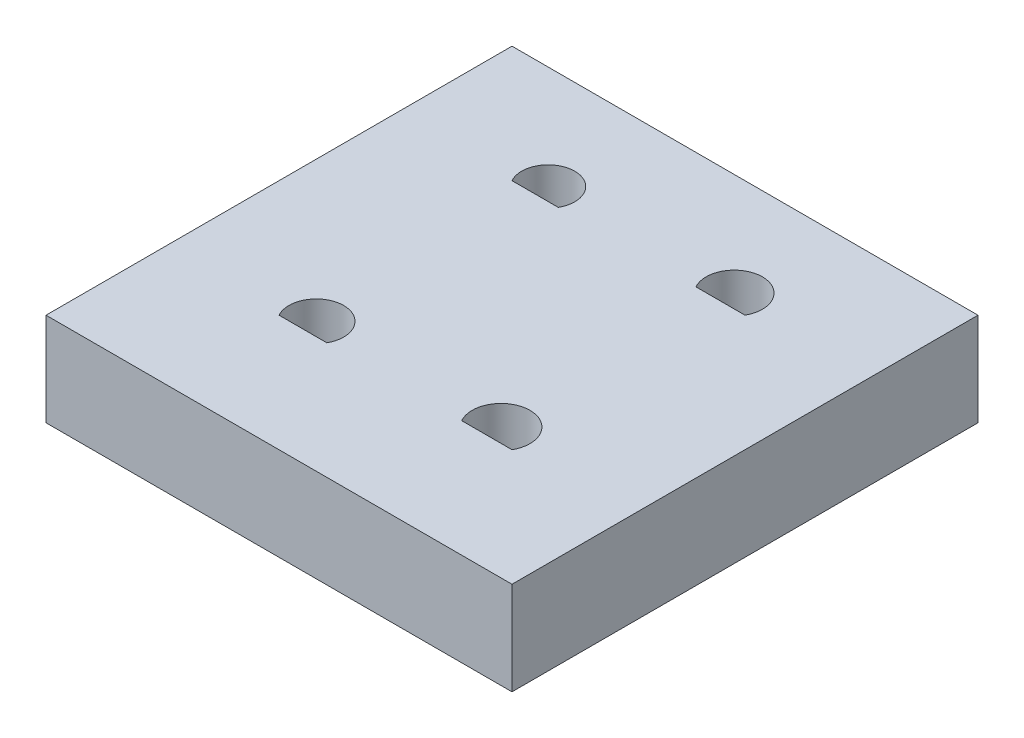
ISO-10303-21;
HEADER;
FILE_DESCRIPTION(('STEP AP214'),'2;1');
FILE_NAME('part.step','',(''),(''),'','','');
FILE_SCHEMA(('AUTOMOTIVE_DESIGN { 1 0 10303 214 1 1 1 1 }'));
ENDSEC;
DATA;
#1=APPLICATION_CONTEXT('core data for automotive mechanical design processes');
#2=APPLICATION_PROTOCOL_DEFINITION('international standard','automotive_design',2000,#1);
#3=PRODUCT_CONTEXT('',#1,'mechanical');
#4=PRODUCT('Part','Part','',(#3));
#5=PRODUCT_RELATED_PRODUCT_CATEGORY('part','',(#4));
#6=PRODUCT_DEFINITION_FORMATION('','',#4);
#7=PRODUCT_DEFINITION_CONTEXT('part definition',#1,'design');
#8=PRODUCT_DEFINITION('design','',#6,#7);
#9=PRODUCT_DEFINITION_SHAPE('','',#8);
#10=(LENGTH_UNIT() NAMED_UNIT(*) SI_UNIT(.MILLI.,.METRE.));
#11=(NAMED_UNIT(*) PLANE_ANGLE_UNIT() SI_UNIT($,.RADIAN.));
#12=(NAMED_UNIT(*) SI_UNIT($,.STERADIAN.) SOLID_ANGLE_UNIT());
#13=UNCERTAINTY_MEASURE_WITH_UNIT(LENGTH_MEASURE(1.E-05),#10,'distance_accuracy_value','');
#14=(GEOMETRIC_REPRESENTATION_CONTEXT(3) GLOBAL_UNCERTAINTY_ASSIGNED_CONTEXT((#13)) GLOBAL_UNIT_ASSIGNED_CONTEXT((#10,
#11,#12)) REPRESENTATION_CONTEXT('',''));
#15=CARTESIAN_POINT('',(0.,0.,0.));
#16=DIRECTION('',(0.,0.,1.));
#17=DIRECTION('',(1.,0.,0.));
#18=AXIS2_PLACEMENT_3D('',#15,#16,#17);
#19=CARTESIAN_POINT('',(0.,5.08,0.));
#20=DIRECTION('',(1.,0.,0.));
#21=DIRECTION('',(0.,0.,-1.));
#22=AXIS2_PLACEMENT_3D('',#19,#20,#21);
#23=PLANE('',#22);
#24=DIRECTION('',(0.,0.,1.));
#25=VECTOR('',#24,1.);
#26=CARTESIAN_POINT('',(0.,0.,0.));
#27=LINE('',#26,#25);
#28=CARTESIAN_POINT('',(0.,0.,-25.4));
#29=VERTEX_POINT('',#28);
#30=CARTESIAN_POINT('',(0.,0.,0.));
#31=VERTEX_POINT('',#30);
#32=EDGE_CURVE('E188',#29,#31,#27,.T.);
#33=ORIENTED_EDGE('',*,*,#32,.T.);
#34=DIRECTION('',(0.,-1.,0.));
#35=VECTOR('',#34,1.);
#36=CARTESIAN_POINT('',(0.,5.08,0.));
#37=LINE('',#36,#35);
#38=CARTESIAN_POINT('',(0.,5.08,0.));
#39=VERTEX_POINT('',#38);
#40=EDGE_CURVE('E11',#39,#31,#37,.T.);
#41=ORIENTED_EDGE('',*,*,#40,.F.);
#42=DIRECTION('',(0.,0.,1.));
#43=VECTOR('',#42,1.);
#44=CARTESIAN_POINT('',(0.,5.08,0.));
#45=LINE('',#44,#43);
#46=CARTESIAN_POINT('',(0.,5.08,-25.4));
#47=VERTEX_POINT('',#46);
#48=EDGE_CURVE('E191',#47,#39,#45,.T.);
#49=ORIENTED_EDGE('',*,*,#48,.F.);
#50=DIRECTION('',(0.,-1.,0.));
#51=VECTOR('',#50,1.);
#52=CARTESIAN_POINT('',(0.,5.08,-25.4));
#53=LINE('',#52,#51);
#54=EDGE_CURVE('E201',#47,#29,#53,.T.);
#55=ORIENTED_EDGE('',*,*,#54,.T.);
#56=EDGE_LOOP('',(#33,#41,#49,#55));
#57=FACE_BOUND('',#56,.T.);
#58=ADVANCED_FACE('F33',(#57),#23,.F.);
#59=CARTESIAN_POINT('',(0.,5.08,0.));
#60=DIRECTION('',(0.,0.,-1.));
#61=DIRECTION('',(-1.,0.,0.));
#62=AXIS2_PLACEMENT_3D('',#59,#60,#61);
#63=PLANE('',#62);
#64=DIRECTION('',(1.,0.,0.));
#65=VECTOR('',#64,1.);
#66=CARTESIAN_POINT('',(0.,0.,0.));
#67=LINE('',#66,#65);
#68=CARTESIAN_POINT('',(25.4,0.,0.));
#69=VERTEX_POINT('',#68);
#70=EDGE_CURVE('E204',#31,#69,#67,.T.);
#71=ORIENTED_EDGE('',*,*,#70,.T.);
#72=DIRECTION('',(0.,-1.,0.));
#73=VECTOR('',#72,1.);
#74=CARTESIAN_POINT('',(25.4,5.08,0.));
#75=LINE('',#74,#73);
#76=CARTESIAN_POINT('',(25.4,5.08,0.));
#77=VERTEX_POINT('',#76);
#78=EDGE_CURVE('E40',#77,#69,#75,.T.);
#79=ORIENTED_EDGE('',*,*,#78,.F.);
#80=DIRECTION('',(1.,0.,0.));
#81=VECTOR('',#80,1.);
#82=CARTESIAN_POINT('',(0.,5.08,0.));
#83=LINE('',#82,#81);
#84=EDGE_CURVE('E194',#39,#77,#83,.T.);
#85=ORIENTED_EDGE('',*,*,#84,.F.);
#86=ORIENTED_EDGE('',*,*,#40,.T.);
#87=EDGE_LOOP('',(#71,#79,#85,#86));
#88=FACE_BOUND('',#87,.T.);
#89=ADVANCED_FACE('F233',(#88),#63,.F.);
#90=CARTESIAN_POINT('',(25.4,5.08,0.));
#91=DIRECTION('',(-1.,0.,0.));
#92=DIRECTION('',(0.,0.,1.));
#93=AXIS2_PLACEMENT_3D('',#90,#91,#92);
#94=PLANE('',#93);
#95=DIRECTION('',(0.,0.,-1.));
#96=VECTOR('',#95,1.);
#97=CARTESIAN_POINT('',(25.4,0.,0.));
#98=LINE('',#97,#96);
#99=CARTESIAN_POINT('',(25.4,0.,-25.4));
#100=VERTEX_POINT('',#99);
#101=EDGE_CURVE('E206',#69,#100,#98,.T.);
#102=ORIENTED_EDGE('',*,*,#101,.T.);
#103=DIRECTION('',(0.,-1.,0.));
#104=VECTOR('',#103,1.);
#105=CARTESIAN_POINT('',(25.4,5.08,-25.4));
#106=LINE('',#105,#104);
#107=CARTESIAN_POINT('',(25.4,5.08,-25.4));
#108=VERTEX_POINT('',#107);
#109=EDGE_CURVE('E211',#108,#100,#106,.T.);
#110=ORIENTED_EDGE('',*,*,#109,.F.);
#111=DIRECTION('',(0.,0.,-1.));
#112=VECTOR('',#111,1.);
#113=CARTESIAN_POINT('',(25.4,5.08,0.));
#114=LINE('',#113,#112);
#115=EDGE_CURVE('E197',#77,#108,#114,.T.);
#116=ORIENTED_EDGE('',*,*,#115,.F.);
#117=ORIENTED_EDGE('',*,*,#78,.T.);
#118=EDGE_LOOP('',(#102,#110,#116,#117));
#119=FACE_BOUND('',#118,.T.);
#120=ADVANCED_FACE('F218',(#119),#94,.F.);
#121=CARTESIAN_POINT('',(0.,5.08,-25.4));
#122=DIRECTION('',(0.,0.,1.));
#123=DIRECTION('',(1.,0.,0.));
#124=AXIS2_PLACEMENT_3D('',#121,#122,#123);
#125=PLANE('',#124);
#126=DIRECTION('',(-1.,0.,0.));
#127=VECTOR('',#126,1.);
#128=CARTESIAN_POINT('',(0.,0.,-25.4));
#129=LINE('',#128,#127);
#130=EDGE_CURVE('E195',#100,#29,#129,.T.);
#131=ORIENTED_EDGE('',*,*,#130,.T.);
#132=ORIENTED_EDGE('',*,*,#54,.F.);
#133=DIRECTION('',(-1.,0.,0.));
#134=VECTOR('',#133,1.);
#135=CARTESIAN_POINT('',(0.,5.08,-25.4));
#136=LINE('',#135,#134);
#137=EDGE_CURVE('E199',#108,#47,#136,.T.);
#138=ORIENTED_EDGE('',*,*,#137,.F.);
#139=ORIENTED_EDGE('',*,*,#109,.T.);
#140=EDGE_LOOP('',(#131,#132,#138,#139));
#141=FACE_BOUND('',#140,.T.);
#142=ADVANCED_FACE('F226',(#141),#125,.F.);
#143=CARTESIAN_POINT('',(0.,5.08,0.));
#144=DIRECTION('',(0.,-1.,0.));
#145=DIRECTION('',(0.,0.,-1.));
#146=AXIS2_PLACEMENT_3D('',#143,#144,#145);
#147=PLANE('',#146);
#148=DIRECTION('',(1.,0.,0.));
#149=VECTOR('',#148,1.);
#150=CARTESIAN_POINT('',(16.3753908547229,5.08,-19.05));
#151=LINE('',#150,#149);
#152=CARTESIAN_POINT('',(16.3753908547229,5.08,-19.05));
#153=VERTEX_POINT('',#152);
#154=CARTESIAN_POINT('',(19.05,5.08,-19.05));
#155=VERTEX_POINT('',#154);
#156=EDGE_CURVE('E166',#153,#155,#151,.T.);
#157=ORIENTED_EDGE('',*,*,#156,.F.);
#158=CARTESIAN_POINT('',(17.7126954273614,5.08,-19.80184));
#159=DIRECTION('',(0.,1.,0.));
#160=DIRECTION('',(0.,0.,1.));
#161=AXIS2_PLACEMENT_3D('',#158,#159,#160);
#162=CIRCLE('',#161,1.53416);
#163=EDGE_CURVE('E47',#155,#153,#162,.T.);
#164=ORIENTED_EDGE('',*,*,#163,.F.);
#165=EDGE_LOOP('',(#157,#164));
#166=FACE_BOUND('',#165,.T.);
#167=DIRECTION('',(1.,0.,0.));
#168=VECTOR('',#167,1.);
#169=CARTESIAN_POINT('',(6.35,5.08,-19.05));
#170=LINE('',#169,#168);
#171=CARTESIAN_POINT('',(6.35,5.08,-19.05));
#172=VERTEX_POINT('',#171);
#173=CARTESIAN_POINT('',(8.87215733054066,5.08,-19.05));
#174=VERTEX_POINT('',#173);
#175=EDGE_CURVE('E152',#172,#174,#170,.T.);
#176=ORIENTED_EDGE('',*,*,#175,.F.);
#177=CARTESIAN_POINT('',(7.61107866527033,5.08,-19.7612));
#178=DIRECTION('',(0.,1.,0.));
#179=DIRECTION('',(0.,0.,1.));
#180=AXIS2_PLACEMENT_3D('',#177,#178,#179);
#181=CIRCLE('',#180,1.4478);
#182=EDGE_CURVE('E55',#174,#172,#181,.T.);
#183=ORIENTED_EDGE('',*,*,#182,.F.);
#184=EDGE_LOOP('',(#176,#183));
#185=FACE_BOUND('',#184,.T.);
#186=DIRECTION('',(1.,0.,0.));
#187=VECTOR('',#186,1.);
#188=CARTESIAN_POINT('',(6.35,5.08,-6.35));
#189=LINE('',#188,#187);
#190=CARTESIAN_POINT('',(6.35,5.08,-6.35));
#191=VERTEX_POINT('',#190);
#192=CARTESIAN_POINT('',(8.95705976149378,5.08,-6.35));
#193=VERTEX_POINT('',#192);
#194=EDGE_CURVE('E140',#191,#193,#189,.T.);
#195=ORIENTED_EDGE('',*,*,#194,.F.);
#196=CARTESIAN_POINT('',(7.65352988074689,5.08,-7.07898));
#197=DIRECTION('',(0.,1.,0.));
#198=DIRECTION('',(0.,0.,1.));
#199=AXIS2_PLACEMENT_3D('',#196,#197,#198);
#200=CIRCLE('',#199,1.49352);
#201=EDGE_CURVE('E127',#193,#191,#200,.T.);
#202=ORIENTED_EDGE('',*,*,#201,.F.);
#203=EDGE_LOOP('',(#195,#202));
#204=FACE_BOUND('',#203,.T.);
#205=DIRECTION('',(1.,0.,0.));
#206=VECTOR('',#205,1.);
#207=CARTESIAN_POINT('',(16.3078585375659,5.08,-6.35));
#208=LINE('',#207,#206);
#209=CARTESIAN_POINT('',(16.3078585375659,5.08,-6.35));
#210=VERTEX_POINT('',#209);
#211=CARTESIAN_POINT('',(19.05,5.08,-6.35));
#212=VERTEX_POINT('',#211);
#213=EDGE_CURVE('E179',#210,#212,#208,.T.);
#214=ORIENTED_EDGE('',*,*,#213,.F.);
#215=CARTESIAN_POINT('',(17.678929268783,5.08,-7.1247));
#216=DIRECTION('',(0.,1.,0.));
#217=DIRECTION('',(0.,0.,1.));
#218=AXIS2_PLACEMENT_3D('',#215,#216,#217);
#219=CIRCLE('',#218,1.5748);
#220=EDGE_CURVE('E146',#212,#210,#219,.T.);
#221=ORIENTED_EDGE('',*,*,#220,.F.);
#222=EDGE_LOOP('',(#214,#221));
#223=FACE_BOUND('',#222,.T.);
#224=ORIENTED_EDGE('',*,*,#48,.T.);
#225=ORIENTED_EDGE('',*,*,#84,.T.);
#226=ORIENTED_EDGE('',*,*,#115,.T.);
#227=ORIENTED_EDGE('',*,*,#137,.T.);
#228=EDGE_LOOP('',(#224,#225,#226,#227));
#229=FACE_BOUND('',#228,.T.);
#230=ADVANCED_FACE('F232',(#166,#185,#204,#223,#229),#147,.F.);
#231=CARTESIAN_POINT('',(0.,0.,0.));
#232=DIRECTION('',(0.,-1.,0.));
#233=DIRECTION('',(0.,0.,-1.));
#234=AXIS2_PLACEMENT_3D('',#231,#232,#233);
#235=PLANE('',#234);
#236=CARTESIAN_POINT('',(17.7126954273614,0.,-19.80184));
#237=DIRECTION('',(0.,1.,0.));
#238=DIRECTION('',(0.,0.,1.));
#239=AXIS2_PLACEMENT_3D('',#236,#237,#238);
#240=CIRCLE('',#239,1.53416);
#241=CARTESIAN_POINT('',(19.05,0.,-19.05));
#242=VERTEX_POINT('',#241);
#243=CARTESIAN_POINT('',(16.3753908547229,0.,-19.05));
#244=VERTEX_POINT('',#243);
#245=EDGE_CURVE('E162',#242,#244,#240,.T.);
#246=ORIENTED_EDGE('',*,*,#245,.T.);
#247=DIRECTION('',(1.,0.,0.));
#248=VECTOR('',#247,1.);
#249=CARTESIAN_POINT('',(16.3753908547229,0.,-19.05));
#250=LINE('',#249,#248);
#251=EDGE_CURVE('E165',#244,#242,#250,.T.);
#252=ORIENTED_EDGE('',*,*,#251,.T.);
#253=EDGE_LOOP('',(#246,#252));
#254=FACE_BOUND('',#253,.T.);
#255=CARTESIAN_POINT('',(7.61107866527033,0.,-19.7612));
#256=DIRECTION('',(0.,1.,0.));
#257=DIRECTION('',(0.,0.,1.));
#258=AXIS2_PLACEMENT_3D('',#255,#256,#257);
#259=CIRCLE('',#258,1.4478);
#260=CARTESIAN_POINT('',(8.87215733054066,0.,-19.05));
#261=VERTEX_POINT('',#260);
#262=CARTESIAN_POINT('',(6.35,0.,-19.05));
#263=VERTEX_POINT('',#262);
#264=EDGE_CURVE('E148',#261,#263,#259,.T.);
#265=ORIENTED_EDGE('',*,*,#264,.T.);
#266=DIRECTION('',(1.,0.,0.));
#267=VECTOR('',#266,1.);
#268=CARTESIAN_POINT('',(6.35,0.,-19.05));
#269=LINE('',#268,#267);
#270=EDGE_CURVE('E151',#263,#261,#269,.T.);
#271=ORIENTED_EDGE('',*,*,#270,.T.);
#272=EDGE_LOOP('',(#265,#271));
#273=FACE_BOUND('',#272,.T.);
#274=CARTESIAN_POINT('',(7.65352988074689,0.,-7.07898));
#275=DIRECTION('',(0.,1.,0.));
#276=DIRECTION('',(0.,0.,1.));
#277=AXIS2_PLACEMENT_3D('',#274,#275,#276);
#278=CIRCLE('',#277,1.49352);
#279=CARTESIAN_POINT('',(8.95705976149378,0.,-6.35));
#280=VERTEX_POINT('',#279);
#281=CARTESIAN_POINT('',(6.35,0.,-6.35));
#282=VERTEX_POINT('',#281);
#283=EDGE_CURVE('E124',#280,#282,#278,.T.);
#284=ORIENTED_EDGE('',*,*,#283,.T.);
#285=DIRECTION('',(1.,0.,0.));
#286=VECTOR('',#285,1.);
#287=CARTESIAN_POINT('',(6.35,0.,-6.35));
#288=LINE('',#287,#286);
#289=EDGE_CURVE('E132',#282,#280,#288,.T.);
#290=ORIENTED_EDGE('',*,*,#289,.T.);
#291=EDGE_LOOP('',(#284,#290));
#292=FACE_BOUND('',#291,.T.);
#293=CARTESIAN_POINT('',(17.678929268783,0.,-7.1247));
#294=DIRECTION('',(0.,1.,0.));
#295=DIRECTION('',(0.,0.,1.));
#296=AXIS2_PLACEMENT_3D('',#293,#294,#295);
#297=CIRCLE('',#296,1.5748);
#298=CARTESIAN_POINT('',(19.05,0.,-6.35));
#299=VERTEX_POINT('',#298);
#300=CARTESIAN_POINT('',(16.3078585375659,0.,-6.35));
#301=VERTEX_POINT('',#300);
#302=EDGE_CURVE('E175',#299,#301,#297,.T.);
#303=ORIENTED_EDGE('',*,*,#302,.T.);
#304=DIRECTION('',(1.,0.,0.));
#305=VECTOR('',#304,1.);
#306=CARTESIAN_POINT('',(16.3078585375659,0.,-6.35));
#307=LINE('',#306,#305);
#308=EDGE_CURVE('E178',#301,#299,#307,.T.);
#309=ORIENTED_EDGE('',*,*,#308,.T.);
#310=EDGE_LOOP('',(#303,#309));
#311=FACE_BOUND('',#310,.T.);
#312=ORIENTED_EDGE('',*,*,#32,.F.);
#313=ORIENTED_EDGE('',*,*,#130,.F.);
#314=ORIENTED_EDGE('',*,*,#101,.F.);
#315=ORIENTED_EDGE('',*,*,#70,.F.);
#316=EDGE_LOOP('',(#312,#313,#314,#315));
#317=FACE_BOUND('',#316,.T.);
#318=ADVANCED_FACE('F138',(#254,#273,#292,#311,#317),#235,.T.);
#319=CARTESIAN_POINT('',(17.678929268783,0.,-7.1247));
#320=DIRECTION('',(0.,1.,0.));
#321=DIRECTION('',(0.,0.,1.));
#322=AXIS2_PLACEMENT_3D('',#319,#320,#321);
#323=CYLINDRICAL_SURFACE('',#322,1.5748);
#324=ORIENTED_EDGE('',*,*,#220,.T.);
#325=DIRECTION('',(0.,1.,0.));
#326=VECTOR('',#325,1.);
#327=CARTESIAN_POINT('',(16.3078585375659,0.,-6.35));
#328=LINE('',#327,#326);
#329=EDGE_CURVE('E182',#301,#210,#328,.T.);
#330=ORIENTED_EDGE('',*,*,#329,.F.);
#331=ORIENTED_EDGE('',*,*,#302,.F.);
#332=DIRECTION('',(0.,1.,0.));
#333=VECTOR('',#332,1.);
#334=CARTESIAN_POINT('',(19.05,0.,-6.35));
#335=LINE('',#334,#333);
#336=EDGE_CURVE('E186',#299,#212,#335,.T.);
#337=ORIENTED_EDGE('',*,*,#336,.T.);
#338=EDGE_LOOP('',(#324,#330,#331,#337));
#339=FACE_BOUND('',#338,.T.);
#340=ADVANCED_FACE('F245',(#339),#323,.F.);
#341=CARTESIAN_POINT('',(16.3078585375659,0.,-6.35));
#342=DIRECTION('',(0.,0.,1.));
#343=DIRECTION('',(1.,0.,0.));
#344=AXIS2_PLACEMENT_3D('',#341,#342,#343);
#345=PLANE('',#344);
#346=ORIENTED_EDGE('',*,*,#213,.T.);
#347=ORIENTED_EDGE('',*,*,#336,.F.);
#348=ORIENTED_EDGE('',*,*,#308,.F.);
#349=ORIENTED_EDGE('',*,*,#329,.T.);
#350=EDGE_LOOP('',(#346,#347,#348,#349));
#351=FACE_BOUND('',#350,.T.);
#352=ADVANCED_FACE('F252',(#351),#345,.F.);
#353=CARTESIAN_POINT('',(7.65352988074689,0.,-7.07898));
#354=DIRECTION('',(0.,1.,0.));
#355=DIRECTION('',(0.,0.,1.));
#356=AXIS2_PLACEMENT_3D('',#353,#354,#355);
#357=CYLINDRICAL_SURFACE('',#356,1.49352);
#358=ORIENTED_EDGE('',*,*,#201,.T.);
#359=DIRECTION('',(0.,1.,0.));
#360=VECTOR('',#359,1.);
#361=CARTESIAN_POINT('',(6.35,0.,-6.35));
#362=LINE('',#361,#360);
#363=EDGE_CURVE('E120',#282,#191,#362,.T.);
#364=ORIENTED_EDGE('',*,*,#363,.F.);
#365=ORIENTED_EDGE('',*,*,#283,.F.);
#366=DIRECTION('',(0.,1.,0.));
#367=VECTOR('',#366,1.);
#368=CARTESIAN_POINT('',(8.95705976149378,0.,-6.35));
#369=LINE('',#368,#367);
#370=EDGE_CURVE('E131',#280,#193,#369,.T.);
#371=ORIENTED_EDGE('',*,*,#370,.T.);
#372=EDGE_LOOP('',(#358,#364,#365,#371));
#373=FACE_BOUND('',#372,.T.);
#374=ADVANCED_FACE('F122',(#373),#357,.F.);
#375=CARTESIAN_POINT('',(6.35,0.,-6.35));
#376=DIRECTION('',(0.,0.,1.));
#377=DIRECTION('',(1.,0.,0.));
#378=AXIS2_PLACEMENT_3D('',#375,#376,#377);
#379=PLANE('',#378);
#380=ORIENTED_EDGE('',*,*,#194,.T.);
#381=ORIENTED_EDGE('',*,*,#370,.F.);
#382=ORIENTED_EDGE('',*,*,#289,.F.);
#383=ORIENTED_EDGE('',*,*,#363,.T.);
#384=EDGE_LOOP('',(#380,#381,#382,#383));
#385=FACE_BOUND('',#384,.T.);
#386=ADVANCED_FACE('F135',(#385),#379,.F.);
#387=CARTESIAN_POINT('',(7.61107866527033,0.,-19.7612));
#388=DIRECTION('',(0.,1.,0.));
#389=DIRECTION('',(0.,0.,1.));
#390=AXIS2_PLACEMENT_3D('',#387,#388,#389);
#391=CYLINDRICAL_SURFACE('',#390,1.4478);
#392=ORIENTED_EDGE('',*,*,#182,.T.);
#393=DIRECTION('',(0.,1.,0.));
#394=VECTOR('',#393,1.);
#395=CARTESIAN_POINT('',(6.35,0.,-19.05));
#396=LINE('',#395,#394);
#397=EDGE_CURVE('E155',#263,#172,#396,.T.);
#398=ORIENTED_EDGE('',*,*,#397,.F.);
#399=ORIENTED_EDGE('',*,*,#264,.F.);
#400=DIRECTION('',(0.,1.,0.));
#401=VECTOR('',#400,1.);
#402=CARTESIAN_POINT('',(8.87215733054066,0.,-19.05));
#403=LINE('',#402,#401);
#404=EDGE_CURVE('E144',#261,#174,#403,.T.);
#405=ORIENTED_EDGE('',*,*,#404,.T.);
#406=EDGE_LOOP('',(#392,#398,#399,#405));
#407=FACE_BOUND('',#406,.T.);
#408=ADVANCED_FACE('F265',(#407),#391,.F.);
#409=CARTESIAN_POINT('',(6.35,0.,-19.05));
#410=DIRECTION('',(0.,0.,1.));
#411=DIRECTION('',(1.,0.,0.));
#412=AXIS2_PLACEMENT_3D('',#409,#410,#411);
#413=PLANE('',#412);
#414=ORIENTED_EDGE('',*,*,#175,.T.);
#415=ORIENTED_EDGE('',*,*,#404,.F.);
#416=ORIENTED_EDGE('',*,*,#270,.F.);
#417=ORIENTED_EDGE('',*,*,#397,.T.);
#418=EDGE_LOOP('',(#414,#415,#416,#417));
#419=FACE_BOUND('',#418,.T.);
#420=ADVANCED_FACE('F261',(#419),#413,.F.);
#421=CARTESIAN_POINT('',(17.7126954273614,0.,-19.80184));
#422=DIRECTION('',(0.,1.,0.));
#423=DIRECTION('',(0.,0.,1.));
#424=AXIS2_PLACEMENT_3D('',#421,#422,#423);
#425=CYLINDRICAL_SURFACE('',#424,1.53416);
#426=ORIENTED_EDGE('',*,*,#163,.T.);
#427=DIRECTION('',(0.,1.,0.));
#428=VECTOR('',#427,1.);
#429=CARTESIAN_POINT('',(16.3753908547229,0.,-19.05));
#430=LINE('',#429,#428);
#431=EDGE_CURVE('E169',#244,#153,#430,.T.);
#432=ORIENTED_EDGE('',*,*,#431,.F.);
#433=ORIENTED_EDGE('',*,*,#245,.F.);
#434=DIRECTION('',(0.,1.,0.));
#435=VECTOR('',#434,1.);
#436=CARTESIAN_POINT('',(19.05,0.,-19.05));
#437=LINE('',#436,#435);
#438=EDGE_CURVE('E157',#242,#155,#437,.T.);
#439=ORIENTED_EDGE('',*,*,#438,.T.);
#440=EDGE_LOOP('',(#426,#432,#433,#439));
#441=FACE_BOUND('',#440,.T.);
#442=ADVANCED_FACE('F257',(#441),#425,.F.);
#443=CARTESIAN_POINT('',(16.3753908547229,0.,-19.05));
#444=DIRECTION('',(0.,0.,1.));
#445=DIRECTION('',(1.,0.,0.));
#446=AXIS2_PLACEMENT_3D('',#443,#444,#445);
#447=PLANE('',#446);
#448=ORIENTED_EDGE('',*,*,#156,.T.);
#449=ORIENTED_EDGE('',*,*,#438,.F.);
#450=ORIENTED_EDGE('',*,*,#251,.F.);
#451=ORIENTED_EDGE('',*,*,#431,.T.);
#452=EDGE_LOOP('',(#448,#449,#450,#451));
#453=FACE_BOUND('',#452,.T.);
#454=ADVANCED_FACE('F260',(#453),#447,.F.);
#455=CLOSED_SHELL('',(#58,#89,#120,#142,#230,#318,#340,#352,#374,#386,#408,#420,#442,#454));
#456=MANIFOLD_SOLID_BREP('B2',#455);
#457=ADVANCED_BREP_SHAPE_REPRESENTATION('',(#18,#456),#14);
#458=SHAPE_DEFINITION_REPRESENTATION(#9,#457);
ENDSEC;
END-ISO-10303-21;
